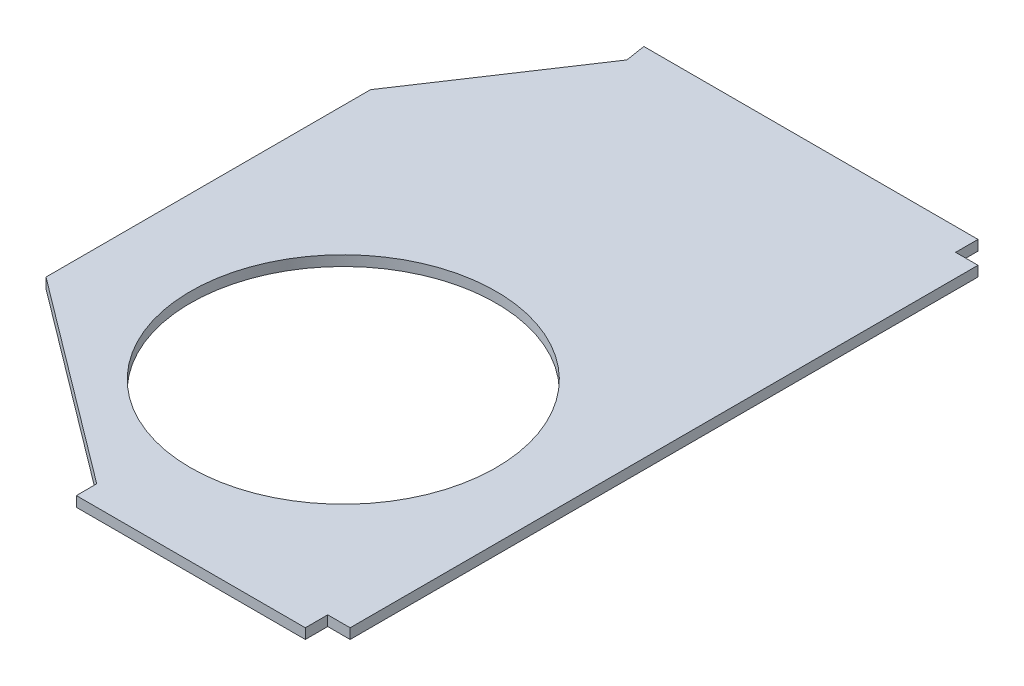
ISO-10303-21;
HEADER;
FILE_DESCRIPTION(('STEP AP214'),'2;1');
FILE_NAME('part.step','',(''),(''),'','','');
FILE_SCHEMA(('AUTOMOTIVE_DESIGN { 1 0 10303 214 1 1 1 1 }'));
ENDSEC;
DATA;
#1=APPLICATION_CONTEXT('core data for automotive mechanical design processes');
#2=APPLICATION_PROTOCOL_DEFINITION('international standard','automotive_design',2000,#1);
#3=PRODUCT_CONTEXT('',#1,'mechanical');
#4=PRODUCT('Part','Part','',(#3));
#5=PRODUCT_RELATED_PRODUCT_CATEGORY('part','',(#4));
#6=PRODUCT_DEFINITION_FORMATION('','',#4);
#7=PRODUCT_DEFINITION_CONTEXT('part definition',#1,'design');
#8=PRODUCT_DEFINITION('design','',#6,#7);
#9=PRODUCT_DEFINITION_SHAPE('','',#8);
#10=(LENGTH_UNIT() NAMED_UNIT(*) SI_UNIT(.MILLI.,.METRE.));
#11=(NAMED_UNIT(*) PLANE_ANGLE_UNIT() SI_UNIT($,.RADIAN.));
#12=(NAMED_UNIT(*) SI_UNIT($,.STERADIAN.) SOLID_ANGLE_UNIT());
#13=UNCERTAINTY_MEASURE_WITH_UNIT(LENGTH_MEASURE(1.E-05),#10,'distance_accuracy_value','');
#14=(GEOMETRIC_REPRESENTATION_CONTEXT(3) GLOBAL_UNCERTAINTY_ASSIGNED_CONTEXT((#13)) GLOBAL_UNIT_ASSIGNED_CONTEXT((#10,
#11,#12)) REPRESENTATION_CONTEXT('',''));
#15=CARTESIAN_POINT('',(0.,0.,0.));
#16=DIRECTION('',(0.,0.,1.));
#17=DIRECTION('',(1.,0.,0.));
#18=AXIS2_PLACEMENT_3D('',#15,#16,#17);
#19=CARTESIAN_POINT('',(0.,10.,0.));
#20=DIRECTION('',(0.,0.,-1.));
#21=DIRECTION('',(-1.,0.,0.));
#22=AXIS2_PLACEMENT_3D('',#19,#20,#21);
#23=PLANE('',#22);
#24=DIRECTION('',(0.,-1.,0.));
#25=VECTOR('',#24,1.);
#26=CARTESIAN_POINT('',(224.777636446773,10.,0.));
#27=LINE('',#26,#25);
#28=CARTESIAN_POINT('',(224.777636446773,10.,0.));
#29=VERTEX_POINT('',#28);
#30=CARTESIAN_POINT('',(224.777636446773,0.,0.));
#31=VERTEX_POINT('',#30);
#32=EDGE_CURVE('E235',#29,#31,#27,.T.);
#33=ORIENTED_EDGE('',*,*,#32,.F.);
#34=DIRECTION('',(1.,0.,0.));
#35=VECTOR('',#34,1.);
#36=CARTESIAN_POINT('',(0.,10.,0.));
#37=LINE('',#36,#35);
#38=CARTESIAN_POINT('',(0.,10.,0.));
#39=VERTEX_POINT('',#38);
#40=EDGE_CURVE('E153',#39,#29,#37,.T.);
#41=ORIENTED_EDGE('',*,*,#40,.F.);
#42=DIRECTION('',(0.,-1.,0.));
#43=VECTOR('',#42,1.);
#44=CARTESIAN_POINT('',(0.,10.,0.));
#45=LINE('',#44,#43);
#46=CARTESIAN_POINT('',(0.,0.,0.));
#47=VERTEX_POINT('',#46);
#48=EDGE_CURVE('E11',#39,#47,#45,.T.);
#49=ORIENTED_EDGE('',*,*,#48,.T.);
#50=DIRECTION('',(1.,0.,0.));
#51=VECTOR('',#50,1.);
#52=CARTESIAN_POINT('',(0.,0.,0.));
#53=LINE('',#52,#51);
#54=EDGE_CURVE('E171',#47,#31,#53,.T.);
#55=ORIENTED_EDGE('',*,*,#54,.T.);
#56=EDGE_LOOP('',(#33,#41,#49,#55));
#57=FACE_BOUND('',#56,.T.);
#58=ADVANCED_FACE('F39',(#57),#23,.F.);
#59=CARTESIAN_POINT('',(246.777636446773,10.,0.));
#60=DIRECTION('',(-1.,0.,0.));
#61=DIRECTION('',(0.,0.,1.));
#62=AXIS2_PLACEMENT_3D('',#59,#60,#61);
#63=PLANE('',#62);
#64=DIRECTION('',(0.,-1.,0.));
#65=VECTOR('',#64,1.);
#66=CARTESIAN_POINT('',(246.777636446773,10.,-638.361240581612));
#67=LINE('',#66,#65);
#68=CARTESIAN_POINT('',(246.777636446773,10.,-638.361240581612));
#69=VERTEX_POINT('',#68);
#70=CARTESIAN_POINT('',(246.777636446773,0.,-638.361240581612));
#71=VERTEX_POINT('',#70);
#72=EDGE_CURVE('E129',#69,#71,#67,.T.);
#73=ORIENTED_EDGE('',*,*,#72,.F.);
#74=DIRECTION('',(0.,0.,-1.));
#75=VECTOR('',#74,1.);
#76=CARTESIAN_POINT('',(246.777636446773,10.,0.));
#77=LINE('',#76,#75);
#78=CARTESIAN_POINT('',(246.777636446773,10.,-22.));
#79=VERTEX_POINT('',#78);
#80=EDGE_CURVE('E141',#79,#69,#77,.T.);
#81=ORIENTED_EDGE('',*,*,#80,.F.);
#82=DIRECTION('',(0.,-1.,0.));
#83=VECTOR('',#82,1.);
#84=CARTESIAN_POINT('',(246.777636446773,10.,-22.));
#85=LINE('',#84,#83);
#86=CARTESIAN_POINT('',(246.777636446773,0.,-22.));
#87=VERTEX_POINT('',#86);
#88=EDGE_CURVE('E240',#79,#87,#85,.T.);
#89=ORIENTED_EDGE('',*,*,#88,.T.);
#90=DIRECTION('',(0.,0.,-1.));
#91=VECTOR('',#90,1.);
#92=CARTESIAN_POINT('',(246.777636446773,0.,0.));
#93=LINE('',#92,#91);
#94=EDGE_CURVE('E144',#87,#71,#93,.T.);
#95=ORIENTED_EDGE('',*,*,#94,.T.);
#96=EDGE_LOOP('',(#73,#81,#89,#95));
#97=FACE_BOUND('',#96,.T.);
#98=ADVANCED_FACE('F143',(#97),#63,.F.);
#99=CARTESIAN_POINT('',(0.,10.,0.));
#100=DIRECTION('',(1.,0.,0.));
#101=DIRECTION('',(0.,0.,-1.));
#102=AXIS2_PLACEMENT_3D('',#99,#100,#101);
#103=PLANE('',#102);
#104=DIRECTION('',(0.,0.,1.));
#105=VECTOR('',#104,1.);
#106=CARTESIAN_POINT('',(0.,0.,0.));
#107=LINE('',#106,#105);
#108=CARTESIAN_POINT('',(0.,0.,-20.));
#109=VERTEX_POINT('',#108);
#110=EDGE_CURVE('E168',#109,#47,#107,.T.);
#111=ORIENTED_EDGE('',*,*,#110,.T.);
#112=ORIENTED_EDGE('',*,*,#48,.F.);
#113=DIRECTION('',(0.,0.,1.));
#114=VECTOR('',#113,1.);
#115=CARTESIAN_POINT('',(0.,10.,0.));
#116=LINE('',#115,#114);
#117=CARTESIAN_POINT('',(0.,10.,-20.));
#118=VERTEX_POINT('',#117);
#119=EDGE_CURVE('E158',#118,#39,#116,.T.);
#120=ORIENTED_EDGE('',*,*,#119,.F.);
#121=DIRECTION('',(0.,-1.,0.));
#122=VECTOR('',#121,1.);
#123=CARTESIAN_POINT('',(0.,10.,-20.));
#124=LINE('',#123,#122);
#125=EDGE_CURVE('E166',#118,#109,#124,.T.);
#126=ORIENTED_EDGE('',*,*,#125,.T.);
#127=EDGE_LOOP('',(#111,#112,#120,#126));
#128=FACE_BOUND('',#127,.T.);
#129=ADVANCED_FACE('F41',(#128),#103,.F.);
#130=CARTESIAN_POINT('',(-103.222363553227,10.,-660.361240581612));
#131=DIRECTION('',(0.,0.,1.));
#132=DIRECTION('',(1.,0.,0.));
#133=AXIS2_PLACEMENT_3D('',#130,#131,#132);
#134=PLANE('',#133);
#135=DIRECTION('',(-1.,0.,0.));
#136=VECTOR('',#135,1.);
#137=CARTESIAN_POINT('',(-103.222363553227,10.,-660.361240581612));
#138=LINE('',#137,#136);
#139=CARTESIAN_POINT('',(224.777636446773,10.,-660.361240581612));
#140=VERTEX_POINT('',#139);
#141=CARTESIAN_POINT('',(-103.222363553227,10.,-660.361240581612));
#142=VERTEX_POINT('',#141);
#143=EDGE_CURVE('E155',#140,#142,#138,.T.);
#144=ORIENTED_EDGE('',*,*,#143,.F.);
#145=DIRECTION('',(0.,-1.,0.));
#146=VECTOR('',#145,1.);
#147=CARTESIAN_POINT('',(224.777636446773,10.,-660.361240581612));
#148=LINE('',#147,#146);
#149=CARTESIAN_POINT('',(224.777636446773,0.,-660.361240581612));
#150=VERTEX_POINT('',#149);
#151=EDGE_CURVE('E174',#140,#150,#148,.T.);
#152=ORIENTED_EDGE('',*,*,#151,.T.);
#153=DIRECTION('',(-1.,0.,0.));
#154=VECTOR('',#153,1.);
#155=CARTESIAN_POINT('',(-103.222363553227,0.,-660.361240581612));
#156=LINE('',#155,#154);
#157=CARTESIAN_POINT('',(-103.222363553227,0.,-660.361240581612));
#158=VERTEX_POINT('',#157);
#159=EDGE_CURVE('E180',#150,#158,#156,.T.);
#160=ORIENTED_EDGE('',*,*,#159,.T.);
#161=DIRECTION('',(0.,-1.,0.));
#162=VECTOR('',#161,1.);
#163=CARTESIAN_POINT('',(-103.222363553227,10.,-660.361240581612));
#164=LINE('',#163,#162);
#165=EDGE_CURVE('E50',#142,#158,#164,.T.);
#166=ORIENTED_EDGE('',*,*,#165,.F.);
#167=EDGE_LOOP('',(#144,#152,#160,#166));
#168=FACE_BOUND('',#167,.T.);
#169=ADVANCED_FACE('F228',(#168),#134,.F.);
#170=CARTESIAN_POINT('',(-103.222363553227,10.,-660.361240581612));
#171=DIRECTION('',(0.988002693948969,0.,-0.154436643156926));
#172=DIRECTION('',(-0.154436643156926,0.,-0.988002693948969));
#173=AXIS2_PLACEMENT_3D('',#170,#171,#172);
#174=PLANE('',#173);
#175=DIRECTION('',(0.154436643156926,0.,0.988002693948969));
#176=VECTOR('',#175,1.);
#177=CARTESIAN_POINT('',(-103.222363553227,0.,-660.361240581612));
#178=LINE('',#177,#176);
#179=CARTESIAN_POINT('',(-100.133630690088,0.,-640.601186702632));
#180=VERTEX_POINT('',#179);
#181=EDGE_CURVE('E177',#158,#180,#178,.T.);
#182=ORIENTED_EDGE('',*,*,#181,.T.);
#183=DIRECTION('',(0.,-1.,0.));
#184=VECTOR('',#183,1.);
#185=CARTESIAN_POINT('',(-100.133630690088,10.,-640.601186702632));
#186=LINE('',#185,#184);
#187=CARTESIAN_POINT('',(-100.133630690088,10.,-640.601186702632));
#188=VERTEX_POINT('',#187);
#189=EDGE_CURVE('E197',#188,#180,#186,.T.);
#190=ORIENTED_EDGE('',*,*,#189,.F.);
#191=DIRECTION('',(0.154436643156926,0.,0.988002693948969));
#192=VECTOR('',#191,1.);
#193=CARTESIAN_POINT('',(-103.222363553227,10.,-660.361240581612));
#194=LINE('',#193,#192);
#195=EDGE_CURVE('E154',#142,#188,#194,.T.);
#196=ORIENTED_EDGE('',*,*,#195,.F.);
#197=ORIENTED_EDGE('',*,*,#165,.T.);
#198=EDGE_LOOP('',(#182,#190,#196,#197));
#199=FACE_BOUND('',#198,.T.);
#200=ADVANCED_FACE('F204',(#199),#174,.F.);
#201=CARTESIAN_POINT('',(-100.133630690088,10.,-640.601186702632));
#202=DIRECTION('',(0.832573744997963,0.,0.553914216409064));
#203=DIRECTION('',(0.553914216409064,0.,-0.832573744997963));
#204=AXIS2_PLACEMENT_3D('',#201,#202,#203);
#205=PLANE('',#204);
#206=DIRECTION('',(-0.553914216409064,0.,0.832573744997963));
#207=VECTOR('',#206,1.);
#208=CARTESIAN_POINT('',(-100.133630690088,0.,-640.601186702632));
#209=LINE('',#208,#207);
#210=CARTESIAN_POINT('',(-200.677997121659,0.,-489.475620290811));
#211=VERTEX_POINT('',#210);
#212=EDGE_CURVE('E185',#180,#211,#209,.T.);
#213=ORIENTED_EDGE('',*,*,#212,.T.);
#214=DIRECTION('',(0.,-1.,0.));
#215=VECTOR('',#214,1.);
#216=CARTESIAN_POINT('',(-200.677997121659,10.,-489.475620290811));
#217=LINE('',#216,#215);
#218=CARTESIAN_POINT('',(-200.677997121659,10.,-489.475620290811));
#219=VERTEX_POINT('',#218);
#220=EDGE_CURVE('E193',#219,#211,#217,.T.);
#221=ORIENTED_EDGE('',*,*,#220,.F.);
#222=DIRECTION('',(-0.553914216409064,0.,0.832573744997963));
#223=VECTOR('',#222,1.);
#224=CARTESIAN_POINT('',(-100.133630690088,10.,-640.601186702632));
#225=LINE('',#224,#223);
#226=EDGE_CURVE('E162',#188,#219,#225,.T.);
#227=ORIENTED_EDGE('',*,*,#226,.F.);
#228=ORIENTED_EDGE('',*,*,#189,.T.);
#229=EDGE_LOOP('',(#213,#221,#227,#228));
#230=FACE_BOUND('',#229,.T.);
#231=ADVANCED_FACE('F216',(#230),#205,.F.);
#232=CARTESIAN_POINT('',(-200.677997121659,10.,-330.180620290811));
#233=DIRECTION('',(1.,0.,0.));
#234=DIRECTION('',(0.,0.,-1.));
#235=AXIS2_PLACEMENT_3D('',#232,#233,#234);
#236=PLANE('',#235);
#237=DIRECTION('',(0.,0.,1.));
#238=VECTOR('',#237,1.);
#239=CARTESIAN_POINT('',(-200.677997121659,0.,-330.180620290811));
#240=LINE('',#239,#238);
#241=CARTESIAN_POINT('',(-200.677997121659,0.,-170.885620290811));
#242=VERTEX_POINT('',#241);
#243=EDGE_CURVE('E183',#211,#242,#240,.T.);
#244=ORIENTED_EDGE('',*,*,#243,.T.);
#245=DIRECTION('',(0.,-1.,0.));
#246=VECTOR('',#245,1.);
#247=CARTESIAN_POINT('',(-200.677997121659,10.,-170.885620290811));
#248=LINE('',#247,#246);
#249=CARTESIAN_POINT('',(-200.677997121659,10.,-170.885620290811));
#250=VERTEX_POINT('',#249);
#251=EDGE_CURVE('E194',#250,#242,#248,.T.);
#252=ORIENTED_EDGE('',*,*,#251,.F.);
#253=DIRECTION('',(0.,0.,1.));
#254=VECTOR('',#253,1.);
#255=CARTESIAN_POINT('',(-200.677997121659,10.,-330.180620290811));
#256=LINE('',#255,#254);
#257=EDGE_CURVE('E164',#219,#250,#256,.T.);
#258=ORIENTED_EDGE('',*,*,#257,.F.);
#259=ORIENTED_EDGE('',*,*,#220,.T.);
#260=EDGE_LOOP('',(#244,#252,#258,#259));
#261=FACE_BOUND('',#260,.T.);
#262=ADVANCED_FACE('F219',(#261),#236,.F.);
#263=CARTESIAN_POINT('',(0.,10.,-20.));
#264=DIRECTION('',(0.600960870722778,0.,-0.799278444511123));
#265=DIRECTION('',(-0.799278444511123,0.,-0.600960870722778));
#266=AXIS2_PLACEMENT_3D('',#263,#264,#265);
#267=PLANE('',#266);
#268=DIRECTION('',(0.799278444511123,0.,0.600960870722778));
#269=VECTOR('',#268,1.);
#270=CARTESIAN_POINT('',(0.,0.,-20.));
#271=LINE('',#270,#269);
#272=EDGE_CURVE('E190',#242,#109,#271,.T.);
#273=ORIENTED_EDGE('',*,*,#272,.T.);
#274=ORIENTED_EDGE('',*,*,#125,.F.);
#275=DIRECTION('',(0.799278444511123,0.,0.600960870722778));
#276=VECTOR('',#275,1.);
#277=CARTESIAN_POINT('',(0.,10.,-20.));
#278=LINE('',#277,#276);
#279=EDGE_CURVE('E170',#250,#118,#278,.T.);
#280=ORIENTED_EDGE('',*,*,#279,.F.);
#281=ORIENTED_EDGE('',*,*,#251,.T.);
#282=EDGE_LOOP('',(#273,#274,#280,#281));
#283=FACE_BOUND('',#282,.T.);
#284=ADVANCED_FACE('F283',(#283),#267,.F.);
#285=CARTESIAN_POINT('',(0.,10.,0.));
#286=DIRECTION('',(0.,-1.,0.));
#287=DIRECTION('',(0.,0.,-1.));
#288=AXIS2_PLACEMENT_3D('',#285,#286,#287);
#289=PLANE('',#288);
#290=CARTESIAN_POINT('',(32.340951638322,10.,-229.684080555497));
#291=DIRECTION('',(0.,1.,0.));
#292=DIRECTION('',(0.,0.,1.));
#293=AXIS2_PLACEMENT_3D('',#290,#291,#292);
#294=CIRCLE('',#293,149.999999999999);
#295=CARTESIAN_POINT('',(32.340951638322,10.,-79.6840805554981));
#296=VERTEX_POINT('',#295);
#297=EDGE_CURVE('E287',#296,#296,#294,.T.);
#298=ORIENTED_EDGE('',*,*,#297,.F.);
#299=EDGE_LOOP('',(#298));
#300=FACE_BOUND('',#299,.T.);
#301=DIRECTION('',(-1.,0.,0.));
#302=VECTOR('',#301,1.);
#303=CARTESIAN_POINT('',(246.777636446773,10.,-638.361240581612));
#304=LINE('',#303,#302);
#305=CARTESIAN_POINT('',(224.777636446773,10.,-638.361240581612));
#306=VERTEX_POINT('',#305);
#307=EDGE_CURVE('E127',#69,#306,#304,.T.);
#308=ORIENTED_EDGE('',*,*,#307,.T.);
#309=DIRECTION('',(0.,0.,-1.));
#310=VECTOR('',#309,1.);
#311=CARTESIAN_POINT('',(224.777636446773,10.,-660.361240581612));
#312=LINE('',#311,#310);
#313=EDGE_CURVE('E132',#306,#140,#312,.T.);
#314=ORIENTED_EDGE('',*,*,#313,.T.);
#315=ORIENTED_EDGE('',*,*,#143,.T.);
#316=ORIENTED_EDGE('',*,*,#195,.T.);
#317=ORIENTED_EDGE('',*,*,#226,.T.);
#318=ORIENTED_EDGE('',*,*,#257,.T.);
#319=ORIENTED_EDGE('',*,*,#279,.T.);
#320=ORIENTED_EDGE('',*,*,#119,.T.);
#321=ORIENTED_EDGE('',*,*,#40,.T.);
#322=DIRECTION('',(0.,0.,-1.));
#323=VECTOR('',#322,1.);
#324=CARTESIAN_POINT('',(224.777636446773,10.,0.));
#325=LINE('',#324,#323);
#326=CARTESIAN_POINT('',(224.777636446773,10.,-22.));
#327=VERTEX_POINT('',#326);
#328=EDGE_CURVE('E245',#29,#327,#325,.T.);
#329=ORIENTED_EDGE('',*,*,#328,.T.);
#330=DIRECTION('',(1.,0.,0.));
#331=VECTOR('',#330,1.);
#332=CARTESIAN_POINT('',(246.777636446773,10.,-22.));
#333=LINE('',#332,#331);
#334=EDGE_CURVE('E151',#327,#79,#333,.T.);
#335=ORIENTED_EDGE('',*,*,#334,.T.);
#336=ORIENTED_EDGE('',*,*,#80,.T.);
#337=EDGE_LOOP('',(#308,#314,#315,#316,#317,#318,#319,#320,#321,#329,#335,#336));
#338=FACE_BOUND('',#337,.T.);
#339=ADVANCED_FACE('F146',(#300,#338),#289,.F.);
#340=CARTESIAN_POINT('',(0.,0.,0.));
#341=DIRECTION('',(0.,-1.,0.));
#342=DIRECTION('',(0.,0.,-1.));
#343=AXIS2_PLACEMENT_3D('',#340,#341,#342);
#344=PLANE('',#343);
#345=CARTESIAN_POINT('',(32.340951638322,0.,-229.684080555497));
#346=DIRECTION('',(0.,1.,0.));
#347=DIRECTION('',(0.,0.,1.));
#348=AXIS2_PLACEMENT_3D('',#345,#346,#347);
#349=CIRCLE('',#348,149.999999999999);
#350=CARTESIAN_POINT('',(32.340951638322,0.,-79.6840805554981));
#351=VERTEX_POINT('',#350);
#352=EDGE_CURVE('E239',#351,#351,#349,.T.);
#353=ORIENTED_EDGE('',*,*,#352,.T.);
#354=EDGE_LOOP('',(#353));
#355=FACE_BOUND('',#354,.T.);
#356=DIRECTION('',(-1.,0.,0.));
#357=VECTOR('',#356,1.);
#358=CARTESIAN_POINT('',(246.777636446773,0.,-638.361240581612));
#359=LINE('',#358,#357);
#360=CARTESIAN_POINT('',(224.777636446773,0.,-638.361240581612));
#361=VERTEX_POINT('',#360);
#362=EDGE_CURVE('E53',#71,#361,#359,.T.);
#363=ORIENTED_EDGE('',*,*,#362,.F.);
#364=ORIENTED_EDGE('',*,*,#94,.F.);
#365=DIRECTION('',(1.,0.,0.));
#366=VECTOR('',#365,1.);
#367=CARTESIAN_POINT('',(246.777636446773,0.,-22.));
#368=LINE('',#367,#366);
#369=CARTESIAN_POINT('',(224.777636446773,0.,-22.));
#370=VERTEX_POINT('',#369);
#371=EDGE_CURVE('E238',#370,#87,#368,.T.);
#372=ORIENTED_EDGE('',*,*,#371,.F.);
#373=DIRECTION('',(0.,0.,-1.));
#374=VECTOR('',#373,1.);
#375=CARTESIAN_POINT('',(224.777636446773,0.,0.));
#376=LINE('',#375,#374);
#377=EDGE_CURVE('E65',#31,#370,#376,.T.);
#378=ORIENTED_EDGE('',*,*,#377,.F.);
#379=ORIENTED_EDGE('',*,*,#54,.F.);
#380=ORIENTED_EDGE('',*,*,#110,.F.);
#381=ORIENTED_EDGE('',*,*,#272,.F.);
#382=ORIENTED_EDGE('',*,*,#243,.F.);
#383=ORIENTED_EDGE('',*,*,#212,.F.);
#384=ORIENTED_EDGE('',*,*,#181,.F.);
#385=ORIENTED_EDGE('',*,*,#159,.F.);
#386=DIRECTION('',(0.,0.,-1.));
#387=VECTOR('',#386,1.);
#388=CARTESIAN_POINT('',(224.777636446773,0.,-660.361240581612));
#389=LINE('',#388,#387);
#390=EDGE_CURVE('E139',#361,#150,#389,.T.);
#391=ORIENTED_EDGE('',*,*,#390,.F.);
#392=EDGE_LOOP('',(#363,#364,#372,#378,#379,#380,#381,#382,#383,#384,#385,#391));
#393=FACE_BOUND('',#392,.T.);
#394=ADVANCED_FACE('F211',(#355,#393),#344,.T.);
#395=CARTESIAN_POINT('',(246.777636446773,10.,-22.));
#396=DIRECTION('',(0.,0.,-1.));
#397=DIRECTION('',(-1.,0.,0.));
#398=AXIS2_PLACEMENT_3D('',#395,#396,#397);
#399=PLANE('',#398);
#400=ORIENTED_EDGE('',*,*,#371,.T.);
#401=ORIENTED_EDGE('',*,*,#88,.F.);
#402=ORIENTED_EDGE('',*,*,#334,.F.);
#403=DIRECTION('',(0.,-1.,0.));
#404=VECTOR('',#403,1.);
#405=CARTESIAN_POINT('',(224.777636446773,10.,-22.));
#406=LINE('',#405,#404);
#407=EDGE_CURVE('E232',#327,#370,#406,.T.);
#408=ORIENTED_EDGE('',*,*,#407,.T.);
#409=EDGE_LOOP('',(#400,#401,#402,#408));
#410=FACE_BOUND('',#409,.T.);
#411=ADVANCED_FACE('F255',(#410),#399,.F.);
#412=CARTESIAN_POINT('',(224.777636446773,10.,0.));
#413=DIRECTION('',(-1.,0.,0.));
#414=DIRECTION('',(0.,0.,1.));
#415=AXIS2_PLACEMENT_3D('',#412,#413,#414);
#416=PLANE('',#415);
#417=ORIENTED_EDGE('',*,*,#377,.T.);
#418=ORIENTED_EDGE('',*,*,#407,.F.);
#419=ORIENTED_EDGE('',*,*,#328,.F.);
#420=ORIENTED_EDGE('',*,*,#32,.T.);
#421=EDGE_LOOP('',(#417,#418,#419,#420));
#422=FACE_BOUND('',#421,.T.);
#423=ADVANCED_FACE('F253',(#422),#416,.F.);
#424=CARTESIAN_POINT('',(224.777636446773,10.,-660.361240581612));
#425=DIRECTION('',(-1.,0.,0.));
#426=DIRECTION('',(0.,0.,1.));
#427=AXIS2_PLACEMENT_3D('',#424,#425,#426);
#428=PLANE('',#427);
#429=ORIENTED_EDGE('',*,*,#390,.T.);
#430=ORIENTED_EDGE('',*,*,#151,.F.);
#431=ORIENTED_EDGE('',*,*,#313,.F.);
#432=DIRECTION('',(0.,-1.,0.));
#433=VECTOR('',#432,1.);
#434=CARTESIAN_POINT('',(224.777636446773,10.,-638.361240581612));
#435=LINE('',#434,#433);
#436=EDGE_CURVE('E128',#306,#361,#435,.T.);
#437=ORIENTED_EDGE('',*,*,#436,.T.);
#438=EDGE_LOOP('',(#429,#430,#431,#437));
#439=FACE_BOUND('',#438,.T.);
#440=ADVANCED_FACE('F261',(#439),#428,.F.);
#441=CARTESIAN_POINT('',(246.777636446773,10.,-638.361240581612));
#442=DIRECTION('',(0.,0.,1.));
#443=DIRECTION('',(1.,0.,0.));
#444=AXIS2_PLACEMENT_3D('',#441,#442,#443);
#445=PLANE('',#444);
#446=ORIENTED_EDGE('',*,*,#362,.T.);
#447=ORIENTED_EDGE('',*,*,#436,.F.);
#448=ORIENTED_EDGE('',*,*,#307,.F.);
#449=ORIENTED_EDGE('',*,*,#72,.T.);
#450=EDGE_LOOP('',(#446,#447,#448,#449));
#451=FACE_BOUND('',#450,.T.);
#452=ADVANCED_FACE('F126',(#451),#445,.F.);
#453=CARTESIAN_POINT('',(32.340951638322,0.,-229.684080555497));
#454=DIRECTION('',(0.,1.,0.));
#455=DIRECTION('',(0.,0.,1.));
#456=AXIS2_PLACEMENT_3D('',#453,#454,#455);
#457=CYLINDRICAL_SURFACE('',#456,149.999999999999);
#458=ORIENTED_EDGE('',*,*,#352,.F.);
#459=EDGE_LOOP('',(#458));
#460=FACE_BOUND('',#459,.T.);
#461=ORIENTED_EDGE('',*,*,#297,.T.);
#462=EDGE_LOOP('',(#461));
#463=FACE_BOUND('',#462,.T.);
#464=ADVANCED_FACE('F297',(#460,#463),#457,.F.);
#465=CLOSED_SHELL('',(#58,#98,#129,#169,#200,#231,#262,#284,#339,#394,#411,#423,#440,#452,#464));
#466=MANIFOLD_SOLID_BREP('B2',#465);
#467=ADVANCED_BREP_SHAPE_REPRESENTATION('',(#18,#466),#14);
#468=SHAPE_DEFINITION_REPRESENTATION(#9,#467);
ENDSEC;
END-ISO-10303-21;
